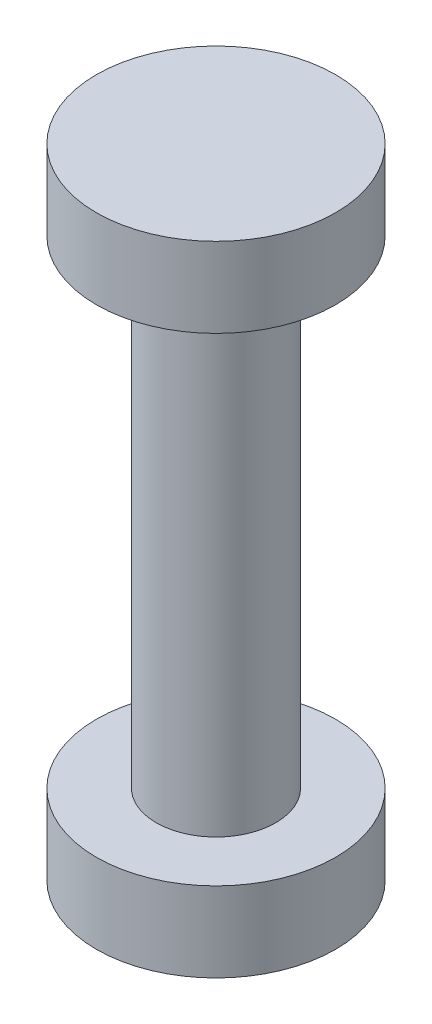
ISO-10303-21;
HEADER;
FILE_DESCRIPTION(('STEP AP214'),'2;1');
FILE_NAME('part.step','',(''),(''),'','','');
FILE_SCHEMA(('AUTOMOTIVE_DESIGN { 1 0 10303 214 1 1 1 1 }'));
ENDSEC;
DATA;
#1=APPLICATION_CONTEXT('core data for automotive mechanical design processes');
#2=APPLICATION_PROTOCOL_DEFINITION('international standard','automotive_design',2000,#1);
#3=PRODUCT_CONTEXT('',#1,'mechanical');
#4=PRODUCT('Part','Part','',(#3));
#5=PRODUCT_RELATED_PRODUCT_CATEGORY('part','',(#4));
#6=PRODUCT_DEFINITION_FORMATION('','',#4);
#7=PRODUCT_DEFINITION_CONTEXT('part definition',#1,'design');
#8=PRODUCT_DEFINITION('design','',#6,#7);
#9=PRODUCT_DEFINITION_SHAPE('','',#8);
#10=(LENGTH_UNIT() NAMED_UNIT(*) SI_UNIT(.MILLI.,.METRE.));
#11=(NAMED_UNIT(*) PLANE_ANGLE_UNIT() SI_UNIT($,.RADIAN.));
#12=(NAMED_UNIT(*) SI_UNIT($,.STERADIAN.) SOLID_ANGLE_UNIT());
#13=UNCERTAINTY_MEASURE_WITH_UNIT(LENGTH_MEASURE(1.E-05),#10,'distance_accuracy_value','');
#14=(GEOMETRIC_REPRESENTATION_CONTEXT(3) GLOBAL_UNCERTAINTY_ASSIGNED_CONTEXT((#13)) GLOBAL_UNIT_ASSIGNED_CONTEXT((#10,
#11,#12)) REPRESENTATION_CONTEXT('',''));
#15=CARTESIAN_POINT('',(0.,0.,0.));
#16=DIRECTION('',(0.,0.,1.));
#17=DIRECTION('',(1.,0.,0.));
#18=AXIS2_PLACEMENT_3D('',#15,#16,#17);
#19=CARTESIAN_POINT('',(0.,-8.,0.));
#20=DIRECTION('',(0.,1.,0.));
#21=DIRECTION('',(0.,0.,1.));
#22=AXIS2_PLACEMENT_3D('',#19,#20,#21);
#23=PLANE('',#22);
#24=CARTESIAN_POINT('',(0.,-8.,0.));
#25=DIRECTION('',(0.,1.,0.));
#26=DIRECTION('',(0.,0.,1.));
#27=AXIS2_PLACEMENT_3D('',#24,#25,#26);
#28=CIRCLE('',#27,3.);
#29=CARTESIAN_POINT('',(0.,-8.,3.));
#30=VERTEX_POINT('',#29);
#31=EDGE_CURVE('E10',#30,#30,#28,.T.);
#32=ORIENTED_EDGE('',*,*,#31,.F.);
#33=EDGE_LOOP('',(#32));
#34=FACE_BOUND('',#33,.T.);
#35=ADVANCED_FACE('F31',(#34),#23,.F.);
#36=CARTESIAN_POINT('',(0.,8.,0.));
#37=DIRECTION('',(0.,1.,0.));
#38=DIRECTION('',(0.,0.,1.));
#39=AXIS2_PLACEMENT_3D('',#36,#37,#38);
#40=CYLINDRICAL_SURFACE('',#39,3.);
#41=CARTESIAN_POINT('',(0.,-6.,0.));
#42=DIRECTION('',(0.,1.,0.));
#43=DIRECTION('',(0.,0.,1.));
#44=AXIS2_PLACEMENT_3D('',#41,#42,#43);
#45=CIRCLE('',#44,3.);
#46=CARTESIAN_POINT('',(0.,-6.,3.));
#47=VERTEX_POINT('',#46);
#48=EDGE_CURVE('E37',#47,#47,#45,.T.);
#49=ORIENTED_EDGE('',*,*,#48,.F.);
#50=EDGE_LOOP('',(#49));
#51=FACE_BOUND('',#50,.T.);
#52=ORIENTED_EDGE('',*,*,#31,.T.);
#53=EDGE_LOOP('',(#52));
#54=FACE_BOUND('',#53,.T.);
#55=ADVANCED_FACE('F79',(#51,#54),#40,.T.);
#56=CARTESIAN_POINT('',(3.,-6.,0.));
#57=DIRECTION('',(0.,-1.,0.));
#58=DIRECTION('',(0.,0.,-1.));
#59=AXIS2_PLACEMENT_3D('',#56,#57,#58);
#60=PLANE('',#59);
#61=CARTESIAN_POINT('',(0.,-6.,0.));
#62=DIRECTION('',(0.,1.,0.));
#63=DIRECTION('',(0.,0.,1.));
#64=AXIS2_PLACEMENT_3D('',#61,#62,#63);
#65=CIRCLE('',#64,1.5);
#66=CARTESIAN_POINT('',(0.,-6.,1.5));
#67=VERTEX_POINT('',#66);
#68=EDGE_CURVE('E41',#67,#67,#65,.T.);
#69=ORIENTED_EDGE('',*,*,#68,.F.);
#70=EDGE_LOOP('',(#69));
#71=FACE_BOUND('',#70,.T.);
#72=ORIENTED_EDGE('',*,*,#48,.T.);
#73=EDGE_LOOP('',(#72));
#74=FACE_BOUND('',#73,.T.);
#75=ADVANCED_FACE('F74',(#71,#74),#60,.F.);
#76=CARTESIAN_POINT('',(0.,8.,0.));
#77=DIRECTION('',(0.,1.,0.));
#78=DIRECTION('',(0.,0.,1.));
#79=AXIS2_PLACEMENT_3D('',#76,#77,#78);
#80=CYLINDRICAL_SURFACE('',#79,1.5);
#81=CARTESIAN_POINT('',(0.,6.,0.));
#82=DIRECTION('',(0.,1.,0.));
#83=DIRECTION('',(0.,0.,1.));
#84=AXIS2_PLACEMENT_3D('',#81,#82,#83);
#85=CIRCLE('',#84,1.5);
#86=CARTESIAN_POINT('',(0.,6.,1.5));
#87=VERTEX_POINT('',#86);
#88=EDGE_CURVE('E45',#87,#87,#85,.T.);
#89=ORIENTED_EDGE('',*,*,#88,.F.);
#90=EDGE_LOOP('',(#89));
#91=FACE_BOUND('',#90,.T.);
#92=ORIENTED_EDGE('',*,*,#68,.T.);
#93=EDGE_LOOP('',(#92));
#94=FACE_BOUND('',#93,.T.);
#95=ADVANCED_FACE('F68',(#91,#94),#80,.T.);
#96=CARTESIAN_POINT('',(3.,6.,0.));
#97=DIRECTION('',(0.,1.,0.));
#98=DIRECTION('',(0.,0.,1.));
#99=AXIS2_PLACEMENT_3D('',#96,#97,#98);
#100=PLANE('',#99);
#101=CARTESIAN_POINT('',(0.,6.,0.));
#102=DIRECTION('',(0.,1.,0.));
#103=DIRECTION('',(0.,0.,1.));
#104=AXIS2_PLACEMENT_3D('',#101,#102,#103);
#105=CIRCLE('',#104,3.);
#106=CARTESIAN_POINT('',(0.,6.,3.));
#107=VERTEX_POINT('',#106);
#108=EDGE_CURVE('E50',#107,#107,#105,.T.);
#109=ORIENTED_EDGE('',*,*,#108,.F.);
#110=EDGE_LOOP('',(#109));
#111=FACE_BOUND('',#110,.T.);
#112=ORIENTED_EDGE('',*,*,#88,.T.);
#113=EDGE_LOOP('',(#112));
#114=FACE_BOUND('',#113,.T.);
#115=ADVANCED_FACE('F62',(#111,#114),#100,.F.);
#116=CARTESIAN_POINT('',(0.,8.,0.));
#117=DIRECTION('',(0.,1.,0.));
#118=DIRECTION('',(0.,0.,1.));
#119=AXIS2_PLACEMENT_3D('',#116,#117,#118);
#120=CYLINDRICAL_SURFACE('',#119,3.);
#121=CARTESIAN_POINT('',(0.,8.,0.));
#122=DIRECTION('',(0.,1.,0.));
#123=DIRECTION('',(0.,0.,1.));
#124=AXIS2_PLACEMENT_3D('',#121,#122,#123);
#125=CIRCLE('',#124,3.);
#126=CARTESIAN_POINT('',(0.,8.,3.));
#127=VERTEX_POINT('',#126);
#128=EDGE_CURVE('E53',#127,#127,#125,.T.);
#129=ORIENTED_EDGE('',*,*,#128,.F.);
#130=EDGE_LOOP('',(#129));
#131=FACE_BOUND('',#130,.T.);
#132=ORIENTED_EDGE('',*,*,#108,.T.);
#133=EDGE_LOOP('',(#132));
#134=FACE_BOUND('',#133,.T.);
#135=ADVANCED_FACE('F59',(#131,#134),#120,.T.);
#136=CARTESIAN_POINT('',(0.,8.,0.));
#137=DIRECTION('',(0.,-1.,0.));
#138=DIRECTION('',(0.,0.,-1.));
#139=AXIS2_PLACEMENT_3D('',#136,#137,#138);
#140=PLANE('',#139);
#141=ORIENTED_EDGE('',*,*,#128,.T.);
#142=EDGE_LOOP('',(#141));
#143=FACE_BOUND('',#142,.T.);
#144=ADVANCED_FACE('F57',(#143),#140,.F.);
#145=CLOSED_SHELL('',(#35,#55,#75,#95,#115,#135,#144));
#146=MANIFOLD_SOLID_BREP('B2',#145);
#147=ADVANCED_BREP_SHAPE_REPRESENTATION('',(#18,#146),#14);
#148=SHAPE_DEFINITION_REPRESENTATION(#9,#147);
ENDSEC;
END-ISO-10303-21;
